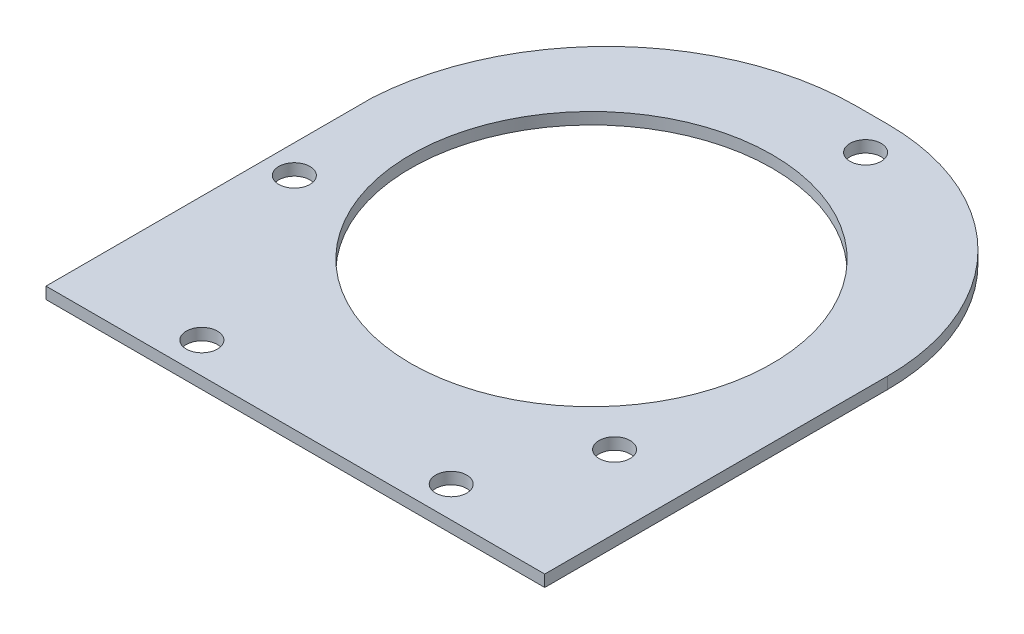
ISO-10303-21;
HEADER;
FILE_DESCRIPTION(('STEP AP214'),'2;1');
FILE_NAME('part.step','',(''),(''),'','','');
FILE_SCHEMA(('AUTOMOTIVE_DESIGN { 1 0 10303 214 1 1 1 1 }'));
ENDSEC;
DATA;
#1=APPLICATION_CONTEXT('core data for automotive mechanical design processes');
#2=APPLICATION_PROTOCOL_DEFINITION('international standard','automotive_design',2000,#1);
#3=PRODUCT_CONTEXT('',#1,'mechanical');
#4=PRODUCT('Part','Part','',(#3));
#5=PRODUCT_RELATED_PRODUCT_CATEGORY('part','',(#4));
#6=PRODUCT_DEFINITION_FORMATION('','',#4);
#7=PRODUCT_DEFINITION_CONTEXT('part definition',#1,'design');
#8=PRODUCT_DEFINITION('design','',#6,#7);
#9=PRODUCT_DEFINITION_SHAPE('','',#8);
#10=(LENGTH_UNIT() NAMED_UNIT(*) SI_UNIT(.MILLI.,.METRE.));
#11=(NAMED_UNIT(*) PLANE_ANGLE_UNIT() SI_UNIT($,.RADIAN.));
#12=(NAMED_UNIT(*) SI_UNIT($,.STERADIAN.) SOLID_ANGLE_UNIT());
#13=UNCERTAINTY_MEASURE_WITH_UNIT(LENGTH_MEASURE(1.E-05),#10,'distance_accuracy_value','');
#14=(GEOMETRIC_REPRESENTATION_CONTEXT(3) GLOBAL_UNCERTAINTY_ASSIGNED_CONTEXT((#13)) GLOBAL_UNIT_ASSIGNED_CONTEXT((#10,
#11,#12)) REPRESENTATION_CONTEXT('',''));
#15=CARTESIAN_POINT('',(0.,0.,0.));
#16=DIRECTION('',(0.,0.,1.));
#17=DIRECTION('',(1.,0.,0.));
#18=AXIS2_PLACEMENT_3D('',#15,#16,#17);
#19=CARTESIAN_POINT('',(12.7,4.7625,-25.4000000000001));
#20=DIRECTION('',(0.,-1.,0.));
#21=DIRECTION('',(0.,0.,-1.));
#22=AXIS2_PLACEMENT_3D('',#19,#20,#21);
#23=PLANE('',#22);
#24=CARTESIAN_POINT('',(18.174556809617,4.7625,-99.84998922339));
#25=DIRECTION('',(0.,1.,0.));
#26=DIRECTION('',(0.,0.,1.));
#27=AXIS2_PLACEMENT_3D('',#24,#25,#26);
#28=CIRCLE('',#27,6.35000000000001);
#29=CARTESIAN_POINT('',(18.174556809617,4.7625,-93.49998922339));
#30=VERTEX_POINT('',#29);
#31=EDGE_CURVE('E233',#30,#30,#28,.T.);
#32=ORIENTED_EDGE('',*,*,#31,.F.);
#33=EDGE_LOOP('',(#32));
#34=FACE_BOUND('',#33,.T.);
#35=CARTESIAN_POINT('',(-50.8,4.7625,101.6));
#36=DIRECTION('',(0.,1.,0.));
#37=DIRECTION('',(0.,0.,1.));
#38=AXIS2_PLACEMENT_3D('',#35,#36,#37);
#39=CIRCLE('',#38,6.35);
#40=CARTESIAN_POINT('',(-50.8,4.7625,107.95));
#41=VERTEX_POINT('',#40);
#42=EDGE_CURVE('E249',#41,#41,#39,.T.);
#43=ORIENTED_EDGE('',*,*,#42,.F.);
#44=EDGE_LOOP('',(#43));
#45=FACE_BOUND('',#44,.T.);
#46=CARTESIAN_POINT('',(0.,4.7625,-6.35000000000014));
#47=DIRECTION('',(0.,1.,0.));
#48=DIRECTION('',(0.,0.,1.));
#49=AXIS2_PLACEMENT_3D('',#46,#47,#48);
#50=CIRCLE('',#49,73.66);
#51=CARTESIAN_POINT('',(0.,4.7625,67.3099999999999));
#52=VERTEX_POINT('',#51);
#53=EDGE_CURVE('E146',#52,#52,#50,.T.);
#54=ORIENTED_EDGE('',*,*,#53,.F.);
#55=EDGE_LOOP('',(#54));
#56=FACE_BOUND('',#55,.T.);
#57=DIRECTION('',(0.,0.,1.));
#58=VECTOR('',#57,1.);
#59=CARTESIAN_POINT('',(-101.6,4.7625,-18.6764705882367));
#60=LINE('',#59,#58);
#61=CARTESIAN_POINT('',(-101.6,4.7625,-18.6764705882367));
#62=VERTEX_POINT('',#61);
#63=CARTESIAN_POINT('',(-101.6,4.7625,114.3));
#64=VERTEX_POINT('',#63);
#65=EDGE_CURVE('E157',#62,#64,#60,.T.);
#66=ORIENTED_EDGE('',*,*,#65,.T.);
#67=DIRECTION('',(1.,0.,0.));
#68=VECTOR('',#67,1.);
#69=CARTESIAN_POINT('',(101.6,4.7625,114.3));
#70=LINE('',#69,#68);
#71=CARTESIAN_POINT('',(101.6,4.7625,114.3));
#72=VERTEX_POINT('',#71);
#73=EDGE_CURVE('E103',#64,#72,#70,.T.);
#74=ORIENTED_EDGE('',*,*,#73,.T.);
#75=DIRECTION('',(0.,0.,-1.));
#76=VECTOR('',#75,1.);
#77=CARTESIAN_POINT('',(101.6,4.7625,-25.3999999999995));
#78=LINE('',#77,#76);
#79=CARTESIAN_POINT('',(101.6,4.7625,-25.3999999999995));
#80=VERTEX_POINT('',#79);
#81=EDGE_CURVE('E118',#72,#80,#78,.T.);
#82=ORIENTED_EDGE('',*,*,#81,.T.);
#83=CARTESIAN_POINT('',(12.7,4.7625,-25.4000000000001));
#84=DIRECTION('',(0.,1.,0.));
#85=DIRECTION('',(0.,0.,-1.));
#86=AXIS2_PLACEMENT_3D('',#83,#84,#85);
#87=CIRCLE('',#86,88.9);
#88=CARTESIAN_POINT('',(12.6999999999995,4.7625,-114.3));
#89=VERTEX_POINT('',#88);
#90=EDGE_CURVE('E112',#80,#89,#87,.T.);
#91=ORIENTED_EDGE('',*,*,#90,.T.);
#92=DIRECTION('',(-1.,0.,0.));
#93=VECTOR('',#92,1.);
#94=CARTESIAN_POINT('',(12.6999999999995,4.7625,-114.3));
#95=LINE('',#94,#93);
#96=CARTESIAN_POINT('',(0.,4.7625,-114.3));
#97=VERTEX_POINT('',#96);
#98=EDGE_CURVE('E116',#89,#97,#95,.T.);
#99=ORIENTED_EDGE('',*,*,#98,.T.);
#100=CARTESIAN_POINT('',(0.,4.7625,-12.5132352941176));
#101=DIRECTION('',(0.,1.,0.));
#102=DIRECTION('',(0.,0.,1.));
#103=AXIS2_PLACEMENT_3D('',#100,#101,#102);
#104=CIRCLE('',#103,101.786764705882);
#105=EDGE_CURVE('E59',#97,#62,#104,.T.);
#106=ORIENTED_EDGE('',*,*,#105,.T.);
#107=EDGE_LOOP('',(#66,#74,#82,#91,#99,#106));
#108=FACE_BOUND('',#107,.T.);
#109=CARTESIAN_POINT('',(-90.0606443258351,4.7625,24.6603667120435));
#110=DIRECTION('',(0.,1.,0.));
#111=DIRECTION('',(0.,0.,1.));
#112=AXIS2_PLACEMENT_3D('',#109,#110,#111);
#113=CIRCLE('',#112,6.35);
#114=CARTESIAN_POINT('',(-90.0606443258351,4.7625,31.0103667120435));
#115=VERTEX_POINT('',#114);
#116=EDGE_CURVE('E257',#115,#115,#113,.T.);
#117=ORIENTED_EDGE('',*,*,#116,.F.);
#118=EDGE_LOOP('',(#117));
#119=FACE_BOUND('',#118,.T.);
#120=CARTESIAN_POINT('',(50.8,4.7625,101.6));
#121=DIRECTION('',(0.,1.,0.));
#122=DIRECTION('',(0.,0.,-1.));
#123=AXIS2_PLACEMENT_3D('',#120,#121,#122);
#124=CIRCLE('',#123,6.35);
#125=CARTESIAN_POINT('',(50.8,4.7625,95.2499999999999));
#126=VERTEX_POINT('',#125);
#127=EDGE_CURVE('E241',#126,#126,#124,.T.);
#128=ORIENTED_EDGE('',*,*,#127,.F.);
#129=EDGE_LOOP('',(#128));
#130=FACE_BOUND('',#129,.T.);
#131=CARTESIAN_POINT('',(71.8860875162182,4.7625,56.1396225113469));
#132=DIRECTION('',(0.,1.,0.));
#133=DIRECTION('',(0.,0.,1.));
#134=AXIS2_PLACEMENT_3D('',#131,#132,#133);
#135=CIRCLE('',#134,6.35000000000001);
#136=CARTESIAN_POINT('',(71.8860875162182,4.7625,62.4896225113469));
#137=VERTEX_POINT('',#136);
#138=EDGE_CURVE('E222',#137,#137,#135,.T.);
#139=ORIENTED_EDGE('',*,*,#138,.F.);
#140=EDGE_LOOP('',(#139));
#141=FACE_BOUND('',#140,.T.);
#142=ADVANCED_FACE('F38',(#34,#45,#56,#108,#119,#130,#141),#23,.F.);
#143=CARTESIAN_POINT('',(12.7,0.,-25.4000000000001));
#144=DIRECTION('',(0.,-1.,0.));
#145=DIRECTION('',(0.,0.,-1.));
#146=AXIS2_PLACEMENT_3D('',#143,#144,#145);
#147=PLANE('',#146);
#148=CARTESIAN_POINT('',(18.174556809617,0.,-99.84998922339));
#149=DIRECTION('',(0.,1.,0.));
#150=DIRECTION('',(0.,0.,1.));
#151=AXIS2_PLACEMENT_3D('',#148,#149,#150);
#152=CIRCLE('',#151,6.35000000000001);
#153=CARTESIAN_POINT('',(18.174556809617,0.,-93.49998922339));
#154=VERTEX_POINT('',#153);
#155=EDGE_CURVE('E230',#154,#154,#152,.T.);
#156=ORIENTED_EDGE('',*,*,#155,.T.);
#157=EDGE_LOOP('',(#156));
#158=FACE_BOUND('',#157,.T.);
#159=CARTESIAN_POINT('',(-50.8,0.,101.6));
#160=DIRECTION('',(0.,1.,0.));
#161=DIRECTION('',(0.,0.,1.));
#162=AXIS2_PLACEMENT_3D('',#159,#160,#161);
#163=CIRCLE('',#162,6.35);
#164=CARTESIAN_POINT('',(-50.8,0.,107.95));
#165=VERTEX_POINT('',#164);
#166=EDGE_CURVE('E245',#165,#165,#163,.T.);
#167=ORIENTED_EDGE('',*,*,#166,.T.);
#168=EDGE_LOOP('',(#167));
#169=FACE_BOUND('',#168,.T.);
#170=CARTESIAN_POINT('',(0.,0.,-6.35000000000014));
#171=DIRECTION('',(0.,1.,0.));
#172=DIRECTION('',(0.,0.,1.));
#173=AXIS2_PLACEMENT_3D('',#170,#171,#172);
#174=CIRCLE('',#173,73.66);
#175=CARTESIAN_POINT('',(0.,0.,67.3099999999999));
#176=VERTEX_POINT('',#175);
#177=EDGE_CURVE('E261',#176,#176,#174,.T.);
#178=ORIENTED_EDGE('',*,*,#177,.T.);
#179=EDGE_LOOP('',(#178));
#180=FACE_BOUND('',#179,.T.);
#181=DIRECTION('',(0.,0.,1.));
#182=VECTOR('',#181,1.);
#183=CARTESIAN_POINT('',(-101.6,0.,-18.6764705882367));
#184=LINE('',#183,#182);
#185=CARTESIAN_POINT('',(-101.6,0.,-18.6764705882367));
#186=VERTEX_POINT('',#185);
#187=CARTESIAN_POINT('',(-101.6,0.,114.3));
#188=VERTEX_POINT('',#187);
#189=EDGE_CURVE('E141',#186,#188,#184,.T.);
#190=ORIENTED_EDGE('',*,*,#189,.F.);
#191=CARTESIAN_POINT('',(0.,0.,-12.5132352941176));
#192=DIRECTION('',(0.,1.,0.));
#193=DIRECTION('',(0.,0.,1.));
#194=AXIS2_PLACEMENT_3D('',#191,#192,#193);
#195=CIRCLE('',#194,101.786764705882);
#196=CARTESIAN_POINT('',(0.,0.,-114.3));
#197=VERTEX_POINT('',#196);
#198=EDGE_CURVE('E94',#197,#186,#195,.T.);
#199=ORIENTED_EDGE('',*,*,#198,.F.);
#200=DIRECTION('',(-1.,0.,0.));
#201=VECTOR('',#200,1.);
#202=CARTESIAN_POINT('',(12.6999999999995,0.,-114.3));
#203=LINE('',#202,#201);
#204=CARTESIAN_POINT('',(12.6999999999995,0.,-114.3));
#205=VERTEX_POINT('',#204);
#206=EDGE_CURVE('E87',#205,#197,#203,.T.);
#207=ORIENTED_EDGE('',*,*,#206,.F.);
#208=CARTESIAN_POINT('',(12.7,0.,-25.4000000000001));
#209=DIRECTION('',(0.,1.,0.));
#210=DIRECTION('',(0.,0.,-1.));
#211=AXIS2_PLACEMENT_3D('',#208,#209,#210);
#212=CIRCLE('',#211,88.9);
#213=CARTESIAN_POINT('',(101.6,0.,-25.3999999999995));
#214=VERTEX_POINT('',#213);
#215=EDGE_CURVE('E127',#214,#205,#212,.T.);
#216=ORIENTED_EDGE('',*,*,#215,.F.);
#217=DIRECTION('',(0.,0.,-1.));
#218=VECTOR('',#217,1.);
#219=CARTESIAN_POINT('',(101.6,0.,-25.3999999999995));
#220=LINE('',#219,#218);
#221=CARTESIAN_POINT('',(101.6,0.,114.3));
#222=VERTEX_POINT('',#221);
#223=EDGE_CURVE('E149',#222,#214,#220,.T.);
#224=ORIENTED_EDGE('',*,*,#223,.F.);
#225=DIRECTION('',(1.,0.,0.));
#226=VECTOR('',#225,1.);
#227=CARTESIAN_POINT('',(101.6,0.,114.3));
#228=LINE('',#227,#226);
#229=EDGE_CURVE('E145',#188,#222,#228,.T.);
#230=ORIENTED_EDGE('',*,*,#229,.F.);
#231=EDGE_LOOP('',(#190,#199,#207,#216,#224,#230));
#232=FACE_BOUND('',#231,.T.);
#233=CARTESIAN_POINT('',(-90.0606443258351,0.,24.6603667120435));
#234=DIRECTION('',(0.,1.,0.));
#235=DIRECTION('',(0.,0.,1.));
#236=AXIS2_PLACEMENT_3D('',#233,#234,#235);
#237=CIRCLE('',#236,6.35);
#238=CARTESIAN_POINT('',(-90.0606443258351,0.,31.0103667120435));
#239=VERTEX_POINT('',#238);
#240=EDGE_CURVE('E253',#239,#239,#237,.T.);
#241=ORIENTED_EDGE('',*,*,#240,.T.);
#242=EDGE_LOOP('',(#241));
#243=FACE_BOUND('',#242,.T.);
#244=CARTESIAN_POINT('',(50.8,0.,101.6));
#245=DIRECTION('',(0.,1.,0.));
#246=DIRECTION('',(0.,0.,-1.));
#247=AXIS2_PLACEMENT_3D('',#244,#245,#246);
#248=CIRCLE('',#247,6.35);
#249=CARTESIAN_POINT('',(50.8,0.,95.2499999999999));
#250=VERTEX_POINT('',#249);
#251=EDGE_CURVE('E237',#250,#250,#248,.T.);
#252=ORIENTED_EDGE('',*,*,#251,.T.);
#253=EDGE_LOOP('',(#252));
#254=FACE_BOUND('',#253,.T.);
#255=CARTESIAN_POINT('',(71.8860875162182,0.,56.1396225113469));
#256=DIRECTION('',(0.,1.,0.));
#257=DIRECTION('',(0.,0.,1.));
#258=AXIS2_PLACEMENT_3D('',#255,#256,#257);
#259=CIRCLE('',#258,6.35000000000001);
#260=CARTESIAN_POINT('',(71.8860875162182,0.,62.4896225113469));
#261=VERTEX_POINT('',#260);
#262=EDGE_CURVE('E225',#261,#261,#259,.T.);
#263=ORIENTED_EDGE('',*,*,#262,.T.);
#264=EDGE_LOOP('',(#263));
#265=FACE_BOUND('',#264,.T.);
#266=ADVANCED_FACE('F171',(#158,#169,#180,#232,#243,#254,#265),#147,.T.);
#267=CARTESIAN_POINT('',(-101.6,4.7625,-18.6764705882367));
#268=DIRECTION('',(1.,0.,0.));
#269=DIRECTION('',(0.,0.,-1.));
#270=AXIS2_PLACEMENT_3D('',#267,#268,#269);
#271=PLANE('',#270);
#272=ORIENTED_EDGE('',*,*,#189,.T.);
#273=DIRECTION('',(0.,-1.,0.));
#274=VECTOR('',#273,1.);
#275=CARTESIAN_POINT('',(-101.6,4.7625,114.3));
#276=LINE('',#275,#274);
#277=EDGE_CURVE('E11',#64,#188,#276,.T.);
#278=ORIENTED_EDGE('',*,*,#277,.F.);
#279=ORIENTED_EDGE('',*,*,#65,.F.);
#280=DIRECTION('',(0.,-1.,0.));
#281=VECTOR('',#280,1.);
#282=CARTESIAN_POINT('',(-101.6,4.7625,-18.6764705882367));
#283=LINE('',#282,#281);
#284=EDGE_CURVE('E137',#62,#186,#283,.T.);
#285=ORIENTED_EDGE('',*,*,#284,.T.);
#286=EDGE_LOOP('',(#272,#278,#279,#285));
#287=FACE_BOUND('',#286,.T.);
#288=ADVANCED_FACE('F40',(#287),#271,.F.);
#289=CARTESIAN_POINT('',(101.6,4.7625,114.3));
#290=DIRECTION('',(0.,0.,-1.));
#291=DIRECTION('',(-1.,0.,0.));
#292=AXIS2_PLACEMENT_3D('',#289,#290,#291);
#293=PLANE('',#292);
#294=ORIENTED_EDGE('',*,*,#229,.T.);
#295=DIRECTION('',(0.,-1.,0.));
#296=VECTOR('',#295,1.);
#297=CARTESIAN_POINT('',(101.6,4.7625,114.3));
#298=LINE('',#297,#296);
#299=EDGE_CURVE('E48',#72,#222,#298,.T.);
#300=ORIENTED_EDGE('',*,*,#299,.F.);
#301=ORIENTED_EDGE('',*,*,#73,.F.);
#302=ORIENTED_EDGE('',*,*,#277,.T.);
#303=EDGE_LOOP('',(#294,#300,#301,#302));
#304=FACE_BOUND('',#303,.T.);
#305=ADVANCED_FACE('F341',(#304),#293,.F.);
#306=CARTESIAN_POINT('',(101.6,4.7625,-25.3999999999995));
#307=DIRECTION('',(-1.,0.,0.));
#308=DIRECTION('',(0.,0.,1.));
#309=AXIS2_PLACEMENT_3D('',#306,#307,#308);
#310=PLANE('',#309);
#311=ORIENTED_EDGE('',*,*,#223,.T.);
#312=DIRECTION('',(0.,-1.,0.));
#313=VECTOR('',#312,1.);
#314=CARTESIAN_POINT('',(101.6,4.7625,-25.3999999999995));
#315=LINE('',#314,#313);
#316=EDGE_CURVE('E129',#80,#214,#315,.T.);
#317=ORIENTED_EDGE('',*,*,#316,.F.);
#318=ORIENTED_EDGE('',*,*,#81,.F.);
#319=ORIENTED_EDGE('',*,*,#299,.T.);
#320=EDGE_LOOP('',(#311,#317,#318,#319));
#321=FACE_BOUND('',#320,.T.);
#322=ADVANCED_FACE('F168',(#321),#310,.F.);
#323=CARTESIAN_POINT('',(12.7,4.7625,-25.4000000000001));
#324=DIRECTION('',(0.,-1.,0.));
#325=DIRECTION('',(0.,0.,-1.));
#326=AXIS2_PLACEMENT_3D('',#323,#324,#325);
#327=CYLINDRICAL_SURFACE('',#326,88.9);
#328=ORIENTED_EDGE('',*,*,#215,.T.);
#329=DIRECTION('',(0.,-1.,0.));
#330=VECTOR('',#329,1.);
#331=CARTESIAN_POINT('',(12.6999999999995,4.7625,-114.3));
#332=LINE('',#331,#330);
#333=EDGE_CURVE('E124',#89,#205,#332,.T.);
#334=ORIENTED_EDGE('',*,*,#333,.F.);
#335=ORIENTED_EDGE('',*,*,#90,.F.);
#336=ORIENTED_EDGE('',*,*,#316,.T.);
#337=EDGE_LOOP('',(#328,#334,#335,#336));
#338=FACE_BOUND('',#337,.T.);
#339=ADVANCED_FACE('F125',(#338),#327,.T.);
#340=CARTESIAN_POINT('',(12.6999999999995,4.7625,-114.3));
#341=DIRECTION('',(0.,0.,1.));
#342=DIRECTION('',(1.,0.,0.));
#343=AXIS2_PLACEMENT_3D('',#340,#341,#342);
#344=PLANE('',#343);
#345=ORIENTED_EDGE('',*,*,#206,.T.);
#346=DIRECTION('',(0.,-1.,0.));
#347=VECTOR('',#346,1.);
#348=CARTESIAN_POINT('',(0.,4.7625,-114.3));
#349=LINE('',#348,#347);
#350=EDGE_CURVE('E130',#97,#197,#349,.T.);
#351=ORIENTED_EDGE('',*,*,#350,.F.);
#352=ORIENTED_EDGE('',*,*,#98,.F.);
#353=ORIENTED_EDGE('',*,*,#333,.T.);
#354=EDGE_LOOP('',(#345,#351,#352,#353));
#355=FACE_BOUND('',#354,.T.);
#356=ADVANCED_FACE('F132',(#355),#344,.F.);
#357=CARTESIAN_POINT('',(0.,4.7625,-12.5132352941176));
#358=DIRECTION('',(0.,-1.,0.));
#359=DIRECTION('',(0.,0.,-1.));
#360=AXIS2_PLACEMENT_3D('',#357,#358,#359);
#361=CYLINDRICAL_SURFACE('',#360,101.786764705882);
#362=ORIENTED_EDGE('',*,*,#198,.T.);
#363=ORIENTED_EDGE('',*,*,#284,.F.);
#364=ORIENTED_EDGE('',*,*,#105,.F.);
#365=ORIENTED_EDGE('',*,*,#350,.T.);
#366=EDGE_LOOP('',(#362,#363,#364,#365));
#367=FACE_BOUND('',#366,.T.);
#368=ADVANCED_FACE('F176',(#367),#361,.T.);
#369=CARTESIAN_POINT('',(0.,4.7625,-6.35000000000014));
#370=DIRECTION('',(0.,-1.,0.));
#371=DIRECTION('',(0.,0.,-1.));
#372=AXIS2_PLACEMENT_3D('',#369,#370,#371);
#373=CYLINDRICAL_SURFACE('',#372,73.66);
#374=ORIENTED_EDGE('',*,*,#53,.T.);
#375=EDGE_LOOP('',(#374));
#376=FACE_BOUND('',#375,.T.);
#377=ORIENTED_EDGE('',*,*,#177,.F.);
#378=EDGE_LOOP('',(#377));
#379=FACE_BOUND('',#378,.T.);
#380=ADVANCED_FACE('F178',(#376,#379),#373,.F.);
#381=CARTESIAN_POINT('',(-90.0606443258351,4.7625,24.6603667120435));
#382=DIRECTION('',(0.,-1.,0.));
#383=DIRECTION('',(0.,0.,-1.));
#384=AXIS2_PLACEMENT_3D('',#381,#382,#383);
#385=CYLINDRICAL_SURFACE('',#384,6.35);
#386=ORIENTED_EDGE('',*,*,#116,.T.);
#387=EDGE_LOOP('',(#386));
#388=FACE_BOUND('',#387,.T.);
#389=ORIENTED_EDGE('',*,*,#240,.F.);
#390=EDGE_LOOP('',(#389));
#391=FACE_BOUND('',#390,.T.);
#392=ADVANCED_FACE('F184',(#388,#391),#385,.F.);
#393=CARTESIAN_POINT('',(-50.8,4.7625,101.6));
#394=DIRECTION('',(0.,-1.,0.));
#395=DIRECTION('',(0.,0.,-1.));
#396=AXIS2_PLACEMENT_3D('',#393,#394,#395);
#397=CYLINDRICAL_SURFACE('',#396,6.35);
#398=ORIENTED_EDGE('',*,*,#42,.T.);
#399=EDGE_LOOP('',(#398));
#400=FACE_BOUND('',#399,.T.);
#401=ORIENTED_EDGE('',*,*,#166,.F.);
#402=EDGE_LOOP('',(#401));
#403=FACE_BOUND('',#402,.T.);
#404=ADVANCED_FACE('F201',(#400,#403),#397,.F.);
#405=CARTESIAN_POINT('',(50.8,4.7625,101.6));
#406=DIRECTION('',(0.,-1.,0.));
#407=DIRECTION('',(0.,0.,-1.));
#408=AXIS2_PLACEMENT_3D('',#405,#406,#407);
#409=CYLINDRICAL_SURFACE('',#408,6.35);
#410=ORIENTED_EDGE('',*,*,#127,.T.);
#411=EDGE_LOOP('',(#410));
#412=FACE_BOUND('',#411,.T.);
#413=ORIENTED_EDGE('',*,*,#251,.F.);
#414=EDGE_LOOP('',(#413));
#415=FACE_BOUND('',#414,.T.);
#416=ADVANCED_FACE('F205',(#412,#415),#409,.F.);
#417=CARTESIAN_POINT('',(18.174556809617,4.7625,-99.84998922339));
#418=DIRECTION('',(0.,-1.,0.));
#419=DIRECTION('',(0.,0.,-1.));
#420=AXIS2_PLACEMENT_3D('',#417,#418,#419);
#421=CYLINDRICAL_SURFACE('',#420,6.35000000000001);
#422=ORIENTED_EDGE('',*,*,#31,.T.);
#423=EDGE_LOOP('',(#422));
#424=FACE_BOUND('',#423,.T.);
#425=ORIENTED_EDGE('',*,*,#155,.F.);
#426=EDGE_LOOP('',(#425));
#427=FACE_BOUND('',#426,.T.);
#428=ADVANCED_FACE('F209',(#424,#427),#421,.F.);
#429=CARTESIAN_POINT('',(71.8860875162182,4.7625,56.1396225113469));
#430=DIRECTION('',(0.,-1.,0.));
#431=DIRECTION('',(0.,0.,-1.));
#432=AXIS2_PLACEMENT_3D('',#429,#430,#431);
#433=CYLINDRICAL_SURFACE('',#432,6.35000000000001);
#434=ORIENTED_EDGE('',*,*,#138,.T.);
#435=EDGE_LOOP('',(#434));
#436=FACE_BOUND('',#435,.T.);
#437=ORIENTED_EDGE('',*,*,#262,.F.);
#438=EDGE_LOOP('',(#437));
#439=FACE_BOUND('',#438,.T.);
#440=ADVANCED_FACE('F213',(#436,#439),#433,.F.);
#441=CLOSED_SHELL('',(#142,#266,#288,#305,#322,#339,#356,#368,#380,#392,#404,#416,#428,#440));
#442=MANIFOLD_SOLID_BREP('B2',#441);
#443=ADVANCED_BREP_SHAPE_REPRESENTATION('',(#18,#442),#14);
#444=SHAPE_DEFINITION_REPRESENTATION(#9,#443);
ENDSEC;
END-ISO-10303-21;
